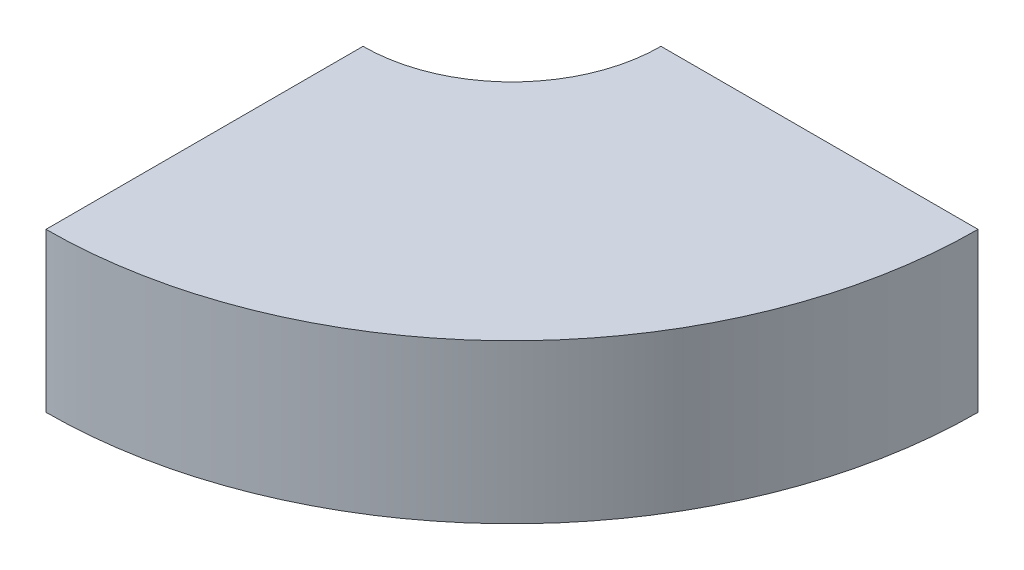
ISO-10303-21;
HEADER;
FILE_DESCRIPTION(('STEP AP214'),'2;1');
FILE_NAME('part.step','',(''),(''),'','','');
FILE_SCHEMA(('AUTOMOTIVE_DESIGN { 1 0 10303 214 1 1 1 1 }'));
ENDSEC;
DATA;
#1=APPLICATION_CONTEXT('core data for automotive mechanical design processes');
#2=APPLICATION_PROTOCOL_DEFINITION('international standard','automotive_design',2000,#1);
#3=PRODUCT_CONTEXT('',#1,'mechanical');
#4=PRODUCT('Part','Part','',(#3));
#5=PRODUCT_RELATED_PRODUCT_CATEGORY('part','',(#4));
#6=PRODUCT_DEFINITION_FORMATION('','',#4);
#7=PRODUCT_DEFINITION_CONTEXT('part definition',#1,'design');
#8=PRODUCT_DEFINITION('design','',#6,#7);
#9=PRODUCT_DEFINITION_SHAPE('','',#8);
#10=(LENGTH_UNIT() NAMED_UNIT(*) SI_UNIT(.MILLI.,.METRE.));
#11=(NAMED_UNIT(*) PLANE_ANGLE_UNIT() SI_UNIT($,.RADIAN.));
#12=(NAMED_UNIT(*) SI_UNIT($,.STERADIAN.) SOLID_ANGLE_UNIT());
#13=UNCERTAINTY_MEASURE_WITH_UNIT(LENGTH_MEASURE(1.E-05),#10,'distance_accuracy_value','');
#14=(GEOMETRIC_REPRESENTATION_CONTEXT(3) GLOBAL_UNCERTAINTY_ASSIGNED_CONTEXT((#13)) GLOBAL_UNIT_ASSIGNED_CONTEXT((#10,
#11,#12)) REPRESENTATION_CONTEXT('',''));
#15=CARTESIAN_POINT('',(0.,0.,0.));
#16=DIRECTION('',(0.,0.,1.));
#17=DIRECTION('',(1.,0.,0.));
#18=AXIS2_PLACEMENT_3D('',#15,#16,#17);
#19=CARTESIAN_POINT('',(0.,2.,0.));
#20=DIRECTION('',(0.,-1.,0.));
#21=DIRECTION('',(0.,0.,-1.));
#22=AXIS2_PLACEMENT_3D('',#19,#20,#21);
#23=CYLINDRICAL_SURFACE('',#22,1.88);
#24=CARTESIAN_POINT('',(0.,0.,0.));
#25=DIRECTION('',(0.,1.,0.));
#26=DIRECTION('',(0.,0.,1.));
#27=AXIS2_PLACEMENT_3D('',#24,#25,#26);
#28=CIRCLE('',#27,1.88);
#29=CARTESIAN_POINT('',(0.,0.,1.88));
#30=VERTEX_POINT('',#29);
#31=CARTESIAN_POINT('',(1.88,0.,0.));
#32=VERTEX_POINT('',#31);
#33=EDGE_CURVE('E109',#30,#32,#28,.T.);
#34=ORIENTED_EDGE('',*,*,#33,.F.);
#35=DIRECTION('',(0.,-1.,0.));
#36=VECTOR('',#35,1.);
#37=CARTESIAN_POINT('',(0.,2.,1.88));
#38=LINE('',#37,#36);
#39=CARTESIAN_POINT('',(0.,2.,1.88));
#40=VERTEX_POINT('',#39);
#41=EDGE_CURVE('E11',#40,#30,#38,.T.);
#42=ORIENTED_EDGE('',*,*,#41,.F.);
#43=CARTESIAN_POINT('',(0.,2.,0.));
#44=DIRECTION('',(0.,1.,0.));
#45=DIRECTION('',(0.,0.,1.));
#46=AXIS2_PLACEMENT_3D('',#43,#44,#45);
#47=CIRCLE('',#46,1.88);
#48=CARTESIAN_POINT('',(1.88,2.,0.));
#49=VERTEX_POINT('',#48);
#50=EDGE_CURVE('E90',#40,#49,#47,.T.);
#51=ORIENTED_EDGE('',*,*,#50,.T.);
#52=DIRECTION('',(0.,-1.,0.));
#53=VECTOR('',#52,1.);
#54=CARTESIAN_POINT('',(1.88,2.,0.));
#55=LINE('',#54,#53);
#56=EDGE_CURVE('E58',#49,#32,#55,.T.);
#57=ORIENTED_EDGE('',*,*,#56,.T.);
#58=EDGE_LOOP('',(#34,#42,#51,#57));
#59=FACE_BOUND('',#58,.T.);
#60=ADVANCED_FACE('F41',(#59),#23,.F.);
#61=CARTESIAN_POINT('',(0.,2.,0.));
#62=DIRECTION('',(1.,0.,0.));
#63=DIRECTION('',(0.,0.,-1.));
#64=AXIS2_PLACEMENT_3D('',#61,#62,#63);
#65=PLANE('',#64);
#66=DIRECTION('',(0.,0.,1.));
#67=VECTOR('',#66,1.);
#68=CARTESIAN_POINT('',(0.,0.,0.));
#69=LINE('',#68,#67);
#70=CARTESIAN_POINT('',(0.,0.,5.88));
#71=VERTEX_POINT('',#70);
#72=EDGE_CURVE('E97',#30,#71,#69,.T.);
#73=ORIENTED_EDGE('',*,*,#72,.T.);
#74=DIRECTION('',(0.,-1.,0.));
#75=VECTOR('',#74,1.);
#76=CARTESIAN_POINT('',(0.,2.,5.88));
#77=LINE('',#76,#75);
#78=CARTESIAN_POINT('',(0.,2.,5.88));
#79=VERTEX_POINT('',#78);
#80=EDGE_CURVE('E50',#79,#71,#77,.T.);
#81=ORIENTED_EDGE('',*,*,#80,.F.);
#82=DIRECTION('',(0.,0.,1.));
#83=VECTOR('',#82,1.);
#84=CARTESIAN_POINT('',(0.,2.,0.));
#85=LINE('',#84,#83);
#86=EDGE_CURVE('E84',#40,#79,#85,.T.);
#87=ORIENTED_EDGE('',*,*,#86,.F.);
#88=ORIENTED_EDGE('',*,*,#41,.T.);
#89=EDGE_LOOP('',(#73,#81,#87,#88));
#90=FACE_BOUND('',#89,.T.);
#91=ADVANCED_FACE('F95',(#90),#65,.F.);
#92=CARTESIAN_POINT('',(0.,2.,0.));
#93=DIRECTION('',(0.,-1.,0.));
#94=DIRECTION('',(0.,0.,-1.));
#95=AXIS2_PLACEMENT_3D('',#92,#93,#94);
#96=CYLINDRICAL_SURFACE('',#95,5.88);
#97=CARTESIAN_POINT('',(0.,0.,0.));
#98=DIRECTION('',(0.,1.,0.));
#99=DIRECTION('',(0.,0.,1.));
#100=AXIS2_PLACEMENT_3D('',#97,#98,#99);
#101=CIRCLE('',#100,5.88);
#102=CARTESIAN_POINT('',(5.88,0.,0.));
#103=VERTEX_POINT('',#102);
#104=EDGE_CURVE('E114',#71,#103,#101,.T.);
#105=ORIENTED_EDGE('',*,*,#104,.T.);
#106=DIRECTION('',(0.,-1.,0.));
#107=VECTOR('',#106,1.);
#108=CARTESIAN_POINT('',(5.88,2.,0.));
#109=LINE('',#108,#107);
#110=CARTESIAN_POINT('',(5.88,2.,0.));
#111=VERTEX_POINT('',#110);
#112=EDGE_CURVE('E72',#111,#103,#109,.T.);
#113=ORIENTED_EDGE('',*,*,#112,.F.);
#114=CARTESIAN_POINT('',(0.,2.,0.));
#115=DIRECTION('',(0.,1.,0.));
#116=DIRECTION('',(0.,0.,1.));
#117=AXIS2_PLACEMENT_3D('',#114,#115,#116);
#118=CIRCLE('',#117,5.88);
#119=EDGE_CURVE('E89',#79,#111,#118,.T.);
#120=ORIENTED_EDGE('',*,*,#119,.F.);
#121=ORIENTED_EDGE('',*,*,#80,.T.);
#122=EDGE_LOOP('',(#105,#113,#120,#121));
#123=FACE_BOUND('',#122,.T.);
#124=ADVANCED_FACE('F101',(#123),#96,.T.);
#125=CARTESIAN_POINT('',(0.,2.,0.));
#126=DIRECTION('',(0.,0.,-1.));
#127=DIRECTION('',(-1.,0.,0.));
#128=AXIS2_PLACEMENT_3D('',#125,#126,#127);
#129=PLANE('',#128);
#130=DIRECTION('',(1.,0.,0.));
#131=VECTOR('',#130,1.);
#132=CARTESIAN_POINT('',(0.,0.,0.));
#133=LINE('',#132,#131);
#134=EDGE_CURVE('E117',#32,#103,#133,.T.);
#135=ORIENTED_EDGE('',*,*,#134,.F.);
#136=ORIENTED_EDGE('',*,*,#56,.F.);
#137=DIRECTION('',(1.,0.,0.));
#138=VECTOR('',#137,1.);
#139=CARTESIAN_POINT('',(0.,2.,0.));
#140=LINE('',#139,#138);
#141=EDGE_CURVE('E103',#49,#111,#140,.T.);
#142=ORIENTED_EDGE('',*,*,#141,.T.);
#143=ORIENTED_EDGE('',*,*,#112,.T.);
#144=EDGE_LOOP('',(#135,#136,#142,#143));
#145=FACE_BOUND('',#144,.T.);
#146=ADVANCED_FACE('F126',(#145),#129,.T.);
#147=CARTESIAN_POINT('',(0.,2.,0.));
#148=DIRECTION('',(0.,1.,0.));
#149=DIRECTION('',(0.,0.,1.));
#150=AXIS2_PLACEMENT_3D('',#147,#148,#149);
#151=PLANE('',#150);
#152=ORIENTED_EDGE('',*,*,#50,.F.);
#153=ORIENTED_EDGE('',*,*,#86,.T.);
#154=ORIENTED_EDGE('',*,*,#119,.T.);
#155=ORIENTED_EDGE('',*,*,#141,.F.);
#156=EDGE_LOOP('',(#152,#153,#154,#155));
#157=FACE_BOUND('',#156,.T.);
#158=ADVANCED_FACE('F86',(#157),#151,.T.);
#159=CARTESIAN_POINT('',(0.,0.,0.));
#160=DIRECTION('',(0.,1.,0.));
#161=DIRECTION('',(0.,0.,1.));
#162=AXIS2_PLACEMENT_3D('',#159,#160,#161);
#163=PLANE('',#162);
#164=ORIENTED_EDGE('',*,*,#33,.T.);
#165=ORIENTED_EDGE('',*,*,#134,.T.);
#166=ORIENTED_EDGE('',*,*,#104,.F.);
#167=ORIENTED_EDGE('',*,*,#72,.F.);
#168=EDGE_LOOP('',(#164,#165,#166,#167));
#169=FACE_BOUND('',#168,.T.);
#170=ADVANCED_FACE('F133',(#169),#163,.F.);
#171=CLOSED_SHELL('',(#60,#91,#124,#146,#158,#170));
#172=MANIFOLD_SOLID_BREP('B2',#171);
#173=ADVANCED_BREP_SHAPE_REPRESENTATION('',(#18,#172),#14);
#174=SHAPE_DEFINITION_REPRESENTATION(#9,#173);
ENDSEC;
END-ISO-10303-21;
